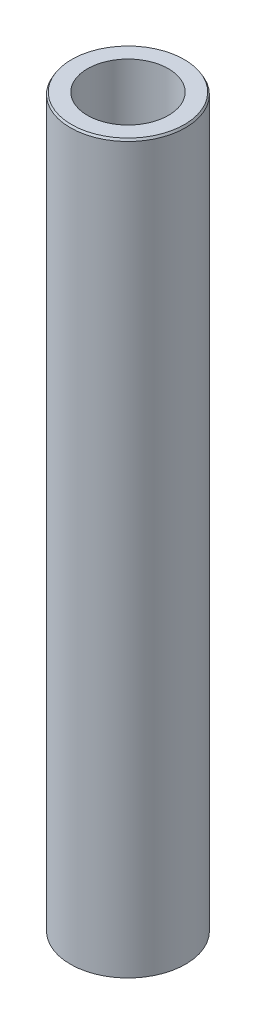
ISO-10303-21;
HEADER;
FILE_DESCRIPTION(('STEP AP214'),'2;1');
FILE_NAME('part.step','',(''),(''),'','','');
FILE_SCHEMA(('AUTOMOTIVE_DESIGN { 1 0 10303 214 1 1 1 1 }'));
ENDSEC;
DATA;
#1=APPLICATION_CONTEXT('core data for automotive mechanical design processes');
#2=APPLICATION_PROTOCOL_DEFINITION('international standard','automotive_design',2000,#1);
#3=PRODUCT_CONTEXT('',#1,'mechanical');
#4=PRODUCT('Part','Part','',(#3));
#5=PRODUCT_RELATED_PRODUCT_CATEGORY('part','',(#4));
#6=PRODUCT_DEFINITION_FORMATION('','',#4);
#7=PRODUCT_DEFINITION_CONTEXT('part definition',#1,'design');
#8=PRODUCT_DEFINITION('design','',#6,#7);
#9=PRODUCT_DEFINITION_SHAPE('','',#8);
#10=(LENGTH_UNIT() NAMED_UNIT(*) SI_UNIT(.MILLI.,.METRE.));
#11=(NAMED_UNIT(*) PLANE_ANGLE_UNIT() SI_UNIT($,.RADIAN.));
#12=(NAMED_UNIT(*) SI_UNIT($,.STERADIAN.) SOLID_ANGLE_UNIT());
#13=UNCERTAINTY_MEASURE_WITH_UNIT(LENGTH_MEASURE(1.E-05),#10,'distance_accuracy_value','');
#14=(GEOMETRIC_REPRESENTATION_CONTEXT(3) GLOBAL_UNCERTAINTY_ASSIGNED_CONTEXT((#13)) GLOBAL_UNIT_ASSIGNED_CONTEXT((#10,
#11,#12)) REPRESENTATION_CONTEXT('',''));
#15=CARTESIAN_POINT('',(0.,0.,0.));
#16=DIRECTION('',(0.,0.,1.));
#17=DIRECTION('',(1.,0.,0.));
#18=AXIS2_PLACEMENT_3D('',#15,#16,#17);
#19=CARTESIAN_POINT('',(0.,600.,0.));
#20=DIRECTION('',(0.,-1.,0.));
#21=DIRECTION('',(0.,0.,-1.));
#22=AXIS2_PLACEMENT_3D('',#19,#20,#21);
#23=CYLINDRICAL_SURFACE('',#22,47.5);
#24=CARTESIAN_POINT('',(0.,598.26146433777,0.));
#25=DIRECTION('',(0.,1.,0.));
#26=DIRECTION('',(0.,0.,1.));
#27=AXIS2_PLACEMENT_3D('',#24,#25,#26);
#28=CIRCLE('',#27,47.5);
#29=CARTESIAN_POINT('',(0.,598.26146433777,47.5));
#30=VERTEX_POINT('',#29);
#31=EDGE_CURVE('E50',#30,#30,#28,.F.);
#32=ORIENTED_EDGE('',*,*,#31,.T.);
#33=EDGE_LOOP('',(#32));
#34=FACE_BOUND('',#33,.T.);
#35=CARTESIAN_POINT('',(0.,1.00374403258419,0.));
#36=DIRECTION('',(0.,1.,0.));
#37=DIRECTION('',(0.,0.,1.));
#38=AXIS2_PLACEMENT_3D('',#35,#36,#37);
#39=CIRCLE('',#38,47.5);
#40=CARTESIAN_POINT('',(0.,1.00374403258419,47.5));
#41=VERTEX_POINT('',#40);
#42=EDGE_CURVE('E51',#41,#41,#39,.T.);
#43=ORIENTED_EDGE('',*,*,#42,.T.);
#44=EDGE_LOOP('',(#43));
#45=FACE_BOUND('',#44,.T.);
#46=ADVANCED_FACE('F39',(#34,#45),#23,.T.);
#47=CARTESIAN_POINT('',(0.,600.,0.));
#48=DIRECTION('',(0.,1.,0.));
#49=DIRECTION('',(0.,0.,1.));
#50=AXIS2_PLACEMENT_3D('',#47,#48,#49);
#51=PLANE('',#50);
#52=CARTESIAN_POINT('',(0.,600.,0.));
#53=DIRECTION('',(0.,1.,0.));
#54=DIRECTION('',(0.,0.,1.));
#55=AXIS2_PLACEMENT_3D('',#52,#53,#54);
#56=CIRCLE('',#55,46.4962559674158);
#57=CARTESIAN_POINT('',(0.,600.,46.4962559674158));
#58=VERTEX_POINT('',#57);
#59=EDGE_CURVE('E54',#58,#58,#56,.T.);
#60=ORIENTED_EDGE('',*,*,#59,.T.);
#61=EDGE_LOOP('',(#60));
#62=FACE_BOUND('',#61,.T.);
#63=CARTESIAN_POINT('',(0.,600.,0.));
#64=DIRECTION('',(0.,1.,0.));
#65=DIRECTION('',(0.,0.,1.));
#66=AXIS2_PLACEMENT_3D('',#63,#64,#65);
#67=CIRCLE('',#66,33.3616402549159);
#68=CARTESIAN_POINT('',(0.,600.,33.3616402549159));
#69=VERTEX_POINT('',#68);
#70=EDGE_CURVE('E58',#69,#69,#67,.T.);
#71=ORIENTED_EDGE('',*,*,#70,.F.);
#72=EDGE_LOOP('',(#71));
#73=FACE_BOUND('',#72,.T.);
#74=ADVANCED_FACE('F69',(#62,#73),#51,.T.);
#75=CARTESIAN_POINT('',(0.,0.,0.));
#76=DIRECTION('',(0.,1.,0.));
#77=DIRECTION('',(0.,0.,1.));
#78=AXIS2_PLACEMENT_3D('',#75,#76,#77);
#79=PLANE('',#78);
#80=CARTESIAN_POINT('',(0.,0.,0.));
#81=DIRECTION('',(0.,1.,0.));
#82=DIRECTION('',(0.,0.,1.));
#83=AXIS2_PLACEMENT_3D('',#80,#81,#82);
#84=CIRCLE('',#83,45.7614643377702);
#85=CARTESIAN_POINT('',(0.,0.,45.7614643377702));
#86=VERTEX_POINT('',#85);
#87=EDGE_CURVE('E10',#86,#86,#84,.F.);
#88=ORIENTED_EDGE('',*,*,#87,.T.);
#89=EDGE_LOOP('',(#88));
#90=FACE_BOUND('',#89,.T.);
#91=CARTESIAN_POINT('',(0.,0.,0.));
#92=DIRECTION('',(0.,1.,0.));
#93=DIRECTION('',(0.,0.,1.));
#94=AXIS2_PLACEMENT_3D('',#91,#92,#93);
#95=CIRCLE('',#94,33.3616402549159);
#96=CARTESIAN_POINT('',(0.,0.,33.3616402549159));
#97=VERTEX_POINT('',#96);
#98=EDGE_CURVE('E63',#97,#97,#95,.T.);
#99=ORIENTED_EDGE('',*,*,#98,.T.);
#100=EDGE_LOOP('',(#99));
#101=FACE_BOUND('',#100,.T.);
#102=ADVANCED_FACE('F75',(#90,#101),#79,.F.);
#103=CARTESIAN_POINT('',(0.,600.,0.));
#104=DIRECTION('',(0.,-1.,0.));
#105=DIRECTION('',(0.,0.,-1.));
#106=AXIS2_PLACEMENT_3D('',#103,#104,#105);
#107=CYLINDRICAL_SURFACE('',#106,33.3616402549159);
#108=ORIENTED_EDGE('',*,*,#70,.T.);
#109=EDGE_LOOP('',(#108));
#110=FACE_BOUND('',#109,.T.);
#111=ORIENTED_EDGE('',*,*,#98,.F.);
#112=EDGE_LOOP('',(#111));
#113=FACE_BOUND('',#112,.T.);
#114=ADVANCED_FACE('F70',(#110,#113),#107,.F.);
#115=CARTESIAN_POINT('',(0.,600.,0.));
#116=DIRECTION('',(0.,-1.,0.));
#117=DIRECTION('',(0.,0.,-1.));
#118=AXIS2_PLACEMENT_3D('',#115,#116,#117);
#119=CONICAL_SURFACE('',#118,46.4962559674158,0.52359877559827);
#120=ORIENTED_EDGE('',*,*,#31,.F.);
#121=EDGE_LOOP('',(#120));
#122=FACE_BOUND('',#121,.T.);
#123=ORIENTED_EDGE('',*,*,#59,.F.);
#124=EDGE_LOOP('',(#123));
#125=FACE_BOUND('',#124,.T.);
#126=ADVANCED_FACE('F81',(#122,#125),#119,.T.);
#127=CARTESIAN_POINT('',(0.,1.00374403258419,0.));
#128=DIRECTION('',(0.,1.,0.));
#129=DIRECTION('',(0.,0.,1.));
#130=AXIS2_PLACEMENT_3D('',#127,#128,#129);
#131=CONICAL_SURFACE('',#130,47.5,1.04719755119659);
#132=CARTESIAN_POINT('',(0.,0.,45.7614643377702));
#133=CARTESIAN_POINT('',(0.,0.0104556670060857,45.7795740842517));
#134=CARTESIAN_POINT('',(0.,0.0209113340121709,45.7976838307333));
#135=CARTESIAN_POINT('',(0.,0.0418226680243411,45.8339033236964));
#136=CARTESIAN_POINT('',(0.,0.0522783350304263,45.852013070178));
#137=CARTESIAN_POINT('',(0.,0.0731896690425963,45.8882325631411));
#138=CARTESIAN_POINT('',(0.,0.0836453360486812,45.9063423096227));
#139=CARTESIAN_POINT('',(0.,0.104556670060852,45.9425618025858));
#140=CARTESIAN_POINT('',(0.,0.115012337066938,45.9606715490673));
#141=CARTESIAN_POINT('',(0.,0.135923671079109,45.9968910420305));
#142=CARTESIAN_POINT('',(0.,0.146379338085193,46.015000788512));
#143=CARTESIAN_POINT('',(0.,0.167290672097364,46.0512202814751));
#144=CARTESIAN_POINT('',(0.,0.17774633910345,46.0693300279567));
#145=CARTESIAN_POINT('',(0.,0.198657673115621,46.1055495209198));
#146=CARTESIAN_POINT('',(0.,0.209113340121705,46.1236592674014));
#147=CARTESIAN_POINT('',(0.,0.230024674133875,46.1598787603645));
#148=CARTESIAN_POINT('',(0.,0.24048034113996,46.1779885068461));
#149=CARTESIAN_POINT('',(0.,0.261391675152131,46.2142079998092));
#150=CARTESIAN_POINT('',(0.,0.271847342158217,46.2323177462908));
#151=CARTESIAN_POINT('',(0.,0.292758676170388,46.2685372392539));
#152=CARTESIAN_POINT('',(0.,0.303214343176472,46.2866469857354));
#153=CARTESIAN_POINT('',(0.,0.324125677188643,46.3228664786986));
#154=CARTESIAN_POINT('',(0.,0.334581344194729,46.3409762251801));
#155=CARTESIAN_POINT('',(0.,0.3554926782069,46.3771957181432));
#156=CARTESIAN_POINT('',(0.,0.365948345212985,46.3953054646248));
#157=CARTESIAN_POINT('',(0.,0.386859679225155,46.4315249575879));
#158=CARTESIAN_POINT('',(0.,0.397315346231239,46.4496347040695));
#159=CARTESIAN_POINT('',(0.,0.41822668024341,46.4858541970326));
#160=CARTESIAN_POINT('',(0.,0.428682347249496,46.5039639435142));
#161=CARTESIAN_POINT('',(0.,0.449593681261667,46.5401834364773));
#162=CARTESIAN_POINT('',(0.,0.460049348267751,46.5582931829588));
#163=CARTESIAN_POINT('',(0.,0.480960682279922,46.594512675922));
#164=CARTESIAN_POINT('',(0.,0.491416349286008,46.6126224224035));
#165=CARTESIAN_POINT('',(0.,0.512327683298179,46.6488419153666));
#166=CARTESIAN_POINT('',(0.,0.522783350304264,46.6669516618482));
#167=CARTESIAN_POINT('',(0.,0.543694684316434,46.7031711548113));
#168=CARTESIAN_POINT('',(0.,0.554150351322518,46.7212809012929));
#169=CARTESIAN_POINT('',(0.,0.575061685334689,46.757500394256));
#170=CARTESIAN_POINT('',(0.,0.585517352340776,46.7756101407376));
#171=CARTESIAN_POINT('',(0.,0.606428686352946,46.8118296337007));
#172=CARTESIAN_POINT('',(0.,0.61688435335903,46.8299393801823));
#173=CARTESIAN_POINT('',(0.,0.637795687371201,46.8661588731454));
#174=CARTESIAN_POINT('',(0.,0.648251354377287,46.8842686196269));
#175=CARTESIAN_POINT('',(0.,0.669162688389458,46.9204881125901));
#176=CARTESIAN_POINT('',(0.,0.679618355395543,46.9385978590716));
#177=CARTESIAN_POINT('',(0.,0.700529689407713,46.9748173520347));
#178=CARTESIAN_POINT('',(0.,0.710985356413798,46.9929270985163));
#179=CARTESIAN_POINT('',(0.,0.731896690425969,47.0291465914794));
#180=CARTESIAN_POINT('',(0.,0.742352357432055,47.047256337961));
#181=CARTESIAN_POINT('',(0.,0.763263691444225,47.0834758309241));
#182=CARTESIAN_POINT('',(0.,0.77371935845031,47.1015855774057));
#183=CARTESIAN_POINT('',(0.,0.79463069246248,47.1378050703688));
#184=CARTESIAN_POINT('',(0.,0.805086359468566,47.1559148168503));
#185=CARTESIAN_POINT('',(0.,0.825997693480737,47.1921343098135));
#186=CARTESIAN_POINT('',(0.,0.836453360486822,47.210244056295));
#187=CARTESIAN_POINT('',(0.,0.857364694498992,47.2464635492582));
#188=CARTESIAN_POINT('',(0.,0.867820361505077,47.2645732957397));
#189=CARTESIAN_POINT('',(0.,0.888731695517248,47.3007927887028));
#190=CARTESIAN_POINT('',(0.,0.899187362523334,47.3189025351844));
#191=CARTESIAN_POINT('',(0.,0.920098696535504,47.3551220281475));
#192=CARTESIAN_POINT('',(0.,0.930554363541589,47.3732317746291));
#193=CARTESIAN_POINT('',(0.,0.951465697553759,47.4094512675922));
#194=CARTESIAN_POINT('',(0.,0.961921364559845,47.4275610140738));
#195=CARTESIAN_POINT('',(0.,0.982832698572016,47.4637805070369));
#196=CARTESIAN_POINT('',(0.,0.993288365578102,47.4818902535185));
#197=CARTESIAN_POINT('',(0.,1.00374403258419,47.5));
#198=B_SPLINE_CURVE_WITH_KNOTS('',3,(#132,#133,#134,#135,#136,#137,#138,#139,#140,#141,#142,
#143,#144,#145,#146,#147,#148,#149,#150,#151,#152,#153,#154,#155,#156,#157,#158,#159,#160,#161,
#162,#163,#164,#165,#166,#167,#168,#169,#170,#171,#172,#173,#174,#175,#176,#177,#178,#179,#180,
#181,#182,#183,#184,#185,#186,#187,#188,#189,#190,#191,#192,#193,#194,#195,#196,#197),
.UNSPECIFIED.,.F.,.F.,(4,2,2,2,2,2,2,2,2,2,2,2,2,2,2,2,2,2,2,2,2,2,2,2,2,2,2,2,2,2,2,2,4),(0.,
0.0627340020365067,0.125468004073019,0.188202006109532,0.250936008146039,0.313670010182552,
0.376404012219059,0.439138014255571,0.501872016292084,0.564606018328591,0.627340020365104,
0.69007402240161,0.752808024438123,0.815542026474636,0.878276028511143,0.941010030547656,
1.00374403258416,1.06647803462068,1.12921203665719,1.19194603869369,1.25468004073021,
1.31741404276671,1.38014804480323,1.44288204683974,1.50561604887625,1.56835005091276,
1.63108405294927,1.69381805498578,1.75655205702229,1.8192860590588,1.88202006109531,
1.94475406313182,2.00748806516833),.UNSPECIFIED.);
#199=EDGE_CURVE('BSEAM45',#86,#41,#198,.T.);
#200=ORIENTED_EDGE('',*,*,#87,.F.);
#201=ORIENTED_EDGE('',*,*,#42,.F.);
#202=ORIENTED_EDGE('',*,*,#199,.T.);
#203=ORIENTED_EDGE('',*,*,#199,.F.);
#204=EDGE_LOOP('',(#200,#202,#201,#203));
#205=FACE_BOUND('',#204,.T.);
#206=ADVANCED_FACE('F45',(#205),#131,.T.);
#207=CLOSED_SHELL('',(#46,#74,#102,#114,#126,#206));
#208=MANIFOLD_SOLID_BREP('B2',#207);
#209=ADVANCED_BREP_SHAPE_REPRESENTATION('',(#18,#208),#14);
#210=SHAPE_DEFINITION_REPRESENTATION(#9,#209);
ENDSEC;
END-ISO-10303-21;
